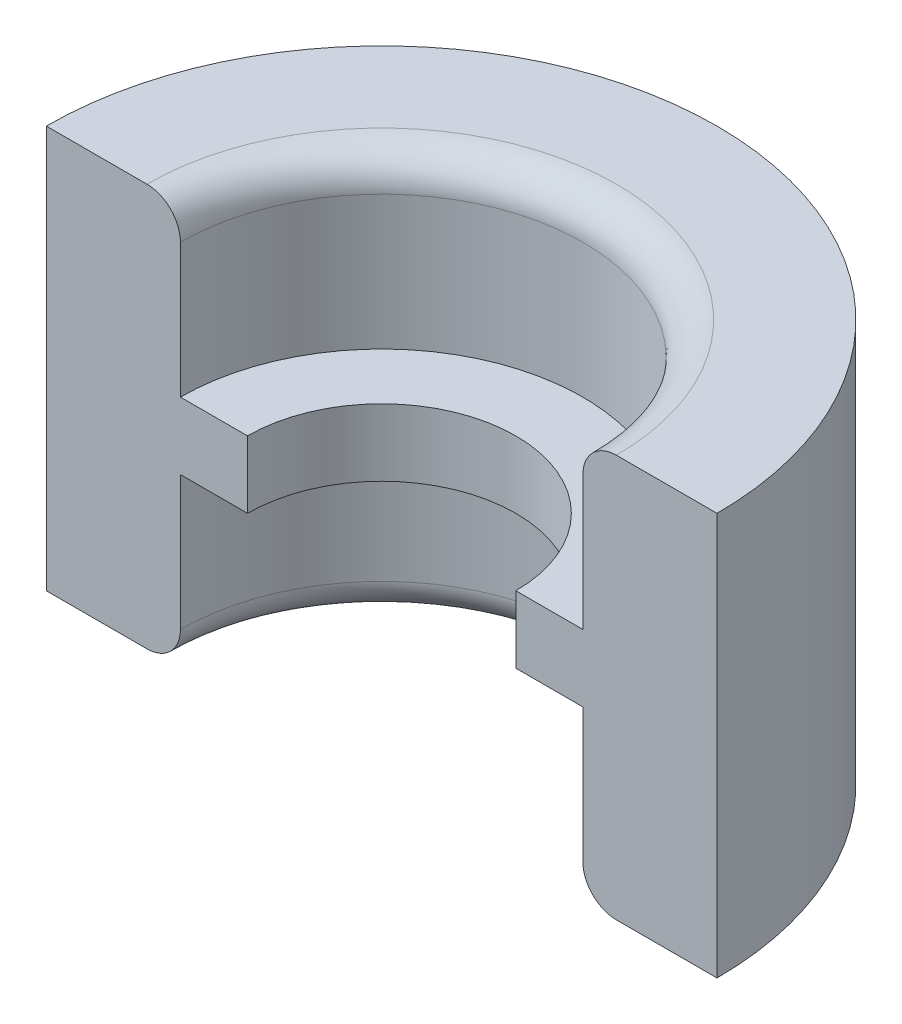
ISO-10303-21;
HEADER;
FILE_DESCRIPTION(('STEP AP214'),'2;1');
FILE_NAME('part.step','',(''),(''),'','','');
FILE_SCHEMA(('AUTOMOTIVE_DESIGN { 1 0 10303 214 1 1 1 1 }'));
ENDSEC;
DATA;
#1=APPLICATION_CONTEXT('core data for automotive mechanical design processes');
#2=APPLICATION_PROTOCOL_DEFINITION('international standard','automotive_design',2000,#1);
#3=PRODUCT_CONTEXT('',#1,'mechanical');
#4=PRODUCT('Part','Part','',(#3));
#5=PRODUCT_RELATED_PRODUCT_CATEGORY('part','',(#4));
#6=PRODUCT_DEFINITION_FORMATION('','',#4);
#7=PRODUCT_DEFINITION_CONTEXT('part definition',#1,'design');
#8=PRODUCT_DEFINITION('design','',#6,#7);
#9=PRODUCT_DEFINITION_SHAPE('','',#8);
#10=(LENGTH_UNIT() NAMED_UNIT(*) SI_UNIT(.MILLI.,.METRE.));
#11=(NAMED_UNIT(*) PLANE_ANGLE_UNIT() SI_UNIT($,.RADIAN.));
#12=(NAMED_UNIT(*) SI_UNIT($,.STERADIAN.) SOLID_ANGLE_UNIT());
#13=UNCERTAINTY_MEASURE_WITH_UNIT(LENGTH_MEASURE(1.E-05),#10,'distance_accuracy_value','');
#14=(GEOMETRIC_REPRESENTATION_CONTEXT(3) GLOBAL_UNCERTAINTY_ASSIGNED_CONTEXT((#13)) GLOBAL_UNIT_ASSIGNED_CONTEXT((#10,
#11,#12)) REPRESENTATION_CONTEXT('',''));
#15=CARTESIAN_POINT('',(0.,0.,0.));
#16=DIRECTION('',(0.,0.,1.));
#17=DIRECTION('',(1.,0.,0.));
#18=AXIS2_PLACEMENT_3D('',#15,#16,#17);
#19=CARTESIAN_POINT('',(0.,0.,0.));
#20=DIRECTION('',(0.,-1.,0.));
#21=DIRECTION('',(0.,0.,-1.));
#22=AXIS2_PLACEMENT_3D('',#19,#20,#21);
#23=CYLINDRICAL_SURFACE('',#22,2.);
#24=CARTESIAN_POINT('',(0.,-0.5,0.));
#25=DIRECTION('',(0.,-1.,0.));
#26=DIRECTION('',(0.,0.,-1.));
#27=AXIS2_PLACEMENT_3D('',#24,#25,#26);
#28=CIRCLE('',#27,2.);
#29=CARTESIAN_POINT('',(-2.,-0.5,0.));
#30=VERTEX_POINT('',#29);
#31=CARTESIAN_POINT('',(2.,-0.5,0.));
#32=VERTEX_POINT('',#31);
#33=EDGE_CURVE('E114',#30,#32,#28,.T.);
#34=ORIENTED_EDGE('',*,*,#33,.T.);
#35=DIRECTION('',(0.,-1.,0.));
#36=VECTOR('',#35,1.);
#37=CARTESIAN_POINT('',(2.,0.,0.));
#38=LINE('',#37,#36);
#39=CARTESIAN_POINT('',(2.,0.5,0.));
#40=VERTEX_POINT('',#39);
#41=EDGE_CURVE('E116',#40,#32,#38,.T.);
#42=ORIENTED_EDGE('',*,*,#41,.F.);
#43=CARTESIAN_POINT('',(0.,0.5,0.));
#44=DIRECTION('',(0.,-1.,0.));
#45=DIRECTION('',(0.,0.,-1.));
#46=AXIS2_PLACEMENT_3D('',#43,#44,#45);
#47=CIRCLE('',#46,2.);
#48=CARTESIAN_POINT('',(-2.,0.5,0.));
#49=VERTEX_POINT('',#48);
#50=EDGE_CURVE('E167',#49,#40,#47,.T.);
#51=ORIENTED_EDGE('',*,*,#50,.F.);
#52=DIRECTION('',(0.,-1.,0.));
#53=VECTOR('',#52,1.);
#54=CARTESIAN_POINT('',(-2.,0.,0.));
#55=LINE('',#54,#53);
#56=EDGE_CURVE('E119',#49,#30,#55,.T.);
#57=ORIENTED_EDGE('',*,*,#56,.T.);
#58=EDGE_LOOP('',(#34,#42,#51,#57));
#59=FACE_BOUND('',#58,.T.);
#60=ADVANCED_FACE('F38',(#59),#23,.F.);
#61=CARTESIAN_POINT('',(0.,-0.5,0.));
#62=DIRECTION('',(0.,-1.,0.));
#63=DIRECTION('',(0.,0.,-1.));
#64=AXIS2_PLACEMENT_3D('',#61,#62,#63);
#65=PLANE('',#64);
#66=CARTESIAN_POINT('',(0.,-0.5,0.));
#67=DIRECTION('',(0.,-1.,0.));
#68=DIRECTION('',(0.,0.,-1.));
#69=AXIS2_PLACEMENT_3D('',#66,#67,#68);
#70=CIRCLE('',#69,3.);
#71=CARTESIAN_POINT('',(-3.,-0.5,0.));
#72=VERTEX_POINT('',#71);
#73=CARTESIAN_POINT('',(3.,-0.5,0.));
#74=VERTEX_POINT('',#73);
#75=EDGE_CURVE('E125',#72,#74,#70,.T.);
#76=ORIENTED_EDGE('',*,*,#75,.T.);
#77=DIRECTION('',(1.,0.,0.));
#78=VECTOR('',#77,1.);
#79=CARTESIAN_POINT('',(0.,-0.500000000000001,0.));
#80=LINE('',#79,#78);
#81=EDGE_CURVE('E131',#32,#74,#80,.T.);
#82=ORIENTED_EDGE('',*,*,#81,.F.);
#83=ORIENTED_EDGE('',*,*,#33,.F.);
#84=DIRECTION('',(-1.,0.,0.));
#85=VECTOR('',#84,1.);
#86=CARTESIAN_POINT('',(0.,-0.500000000000001,0.));
#87=LINE('',#86,#85);
#88=EDGE_CURVE('E151',#30,#72,#87,.T.);
#89=ORIENTED_EDGE('',*,*,#88,.T.);
#90=EDGE_LOOP('',(#76,#82,#83,#89));
#91=FACE_BOUND('',#90,.T.);
#92=ADVANCED_FACE('F136',(#91),#65,.T.);
#93=CARTESIAN_POINT('',(0.,0.,0.));
#94=DIRECTION('',(0.,-1.,0.));
#95=DIRECTION('',(0.,0.,-1.));
#96=AXIS2_PLACEMENT_3D('',#93,#94,#95);
#97=CYLINDRICAL_SURFACE('',#96,3.);
#98=DIRECTION('',(0.,-1.,0.));
#99=VECTOR('',#98,1.);
#100=CARTESIAN_POINT('',(-3.,0.,0.));
#101=LINE('',#100,#99);
#102=CARTESIAN_POINT('',(-3.,-2.5,0.));
#103=VERTEX_POINT('',#102);
#104=EDGE_CURVE('E153',#72,#103,#101,.T.);
#105=ORIENTED_EDGE('',*,*,#104,.T.);
#106=CARTESIAN_POINT('',(0.,-2.5,0.));
#107=DIRECTION('',(0.,-1.,0.));
#108=DIRECTION('',(0.,0.,-1.));
#109=AXIS2_PLACEMENT_3D('',#106,#107,#108);
#110=CIRCLE('',#109,3.);
#111=CARTESIAN_POINT('',(3.,-2.5,0.));
#112=VERTEX_POINT('',#111);
#113=EDGE_CURVE('E124',#103,#112,#110,.T.);
#114=ORIENTED_EDGE('',*,*,#113,.T.);
#115=DIRECTION('',(0.,-1.,0.));
#116=VECTOR('',#115,1.);
#117=CARTESIAN_POINT('',(3.,0.,0.));
#118=LINE('',#117,#116);
#119=EDGE_CURVE('E137',#74,#112,#118,.T.);
#120=ORIENTED_EDGE('',*,*,#119,.F.);
#121=ORIENTED_EDGE('',*,*,#75,.F.);
#122=EDGE_LOOP('',(#105,#114,#120,#121));
#123=FACE_BOUND('',#122,.T.);
#124=ADVANCED_FACE('F212',(#123),#97,.F.);
#125=CARTESIAN_POINT('',(0.,-3.,0.));
#126=DIRECTION('',(0.,-1.,0.));
#127=DIRECTION('',(0.,0.,-1.));
#128=AXIS2_PLACEMENT_3D('',#125,#126,#127);
#129=PLANE('',#128);
#130=DIRECTION('',(1.,0.,0.));
#131=VECTOR('',#130,1.);
#132=CARTESIAN_POINT('',(0.,-3.,0.));
#133=LINE('',#132,#131);
#134=CARTESIAN_POINT('',(3.5,-3.,0.));
#135=VERTEX_POINT('',#134);
#136=CARTESIAN_POINT('',(5.,-3.,0.));
#137=VERTEX_POINT('',#136);
#138=EDGE_CURVE('E139',#135,#137,#133,.T.);
#139=ORIENTED_EDGE('',*,*,#138,.F.);
#140=CARTESIAN_POINT('',(0.,-3.,0.));
#141=DIRECTION('',(0.,-1.,0.));
#142=DIRECTION('',(0.,0.,-1.));
#143=AXIS2_PLACEMENT_3D('',#140,#141,#142);
#144=CIRCLE('',#143,3.5);
#145=CARTESIAN_POINT('',(-3.5,-3.,0.));
#146=VERTEX_POINT('',#145);
#147=EDGE_CURVE('E185',#135,#146,#144,.F.);
#148=ORIENTED_EDGE('',*,*,#147,.T.);
#149=DIRECTION('',(-1.,0.,0.));
#150=VECTOR('',#149,1.);
#151=CARTESIAN_POINT('',(0.,-3.,0.));
#152=LINE('',#151,#150);
#153=CARTESIAN_POINT('',(-5.,-3.,0.));
#154=VERTEX_POINT('',#153);
#155=EDGE_CURVE('E156',#146,#154,#152,.T.);
#156=ORIENTED_EDGE('',*,*,#155,.T.);
#157=CARTESIAN_POINT('',(0.,-3.,0.));
#158=DIRECTION('',(0.,-1.,0.));
#159=DIRECTION('',(0.,0.,-1.));
#160=AXIS2_PLACEMENT_3D('',#157,#158,#159);
#161=CIRCLE('',#160,5.);
#162=EDGE_CURVE('E175',#154,#137,#161,.T.);
#163=ORIENTED_EDGE('',*,*,#162,.T.);
#164=EDGE_LOOP('',(#139,#148,#156,#163));
#165=FACE_BOUND('',#164,.T.);
#166=ADVANCED_FACE('F213',(#165),#129,.T.);
#167=CARTESIAN_POINT('',(0.,0.,0.));
#168=DIRECTION('',(0.,-1.,0.));
#169=DIRECTION('',(0.,0.,-1.));
#170=AXIS2_PLACEMENT_3D('',#167,#168,#169);
#171=CYLINDRICAL_SURFACE('',#170,5.);
#172=CARTESIAN_POINT('',(0.,3.,0.));
#173=DIRECTION('',(0.,-1.,0.));
#174=DIRECTION('',(0.,0.,-1.));
#175=AXIS2_PLACEMENT_3D('',#172,#173,#174);
#176=CIRCLE('',#175,5.);
#177=CARTESIAN_POINT('',(-5.,3.,0.));
#178=VERTEX_POINT('',#177);
#179=CARTESIAN_POINT('',(5.,3.,0.));
#180=VERTEX_POINT('',#179);
#181=EDGE_CURVE('E172',#178,#180,#176,.T.);
#182=ORIENTED_EDGE('',*,*,#181,.T.);
#183=DIRECTION('',(0.,-1.,0.));
#184=VECTOR('',#183,1.);
#185=CARTESIAN_POINT('',(5.,0.,0.));
#186=LINE('',#185,#184);
#187=EDGE_CURVE('E144',#180,#137,#186,.T.);
#188=ORIENTED_EDGE('',*,*,#187,.T.);
#189=ORIENTED_EDGE('',*,*,#162,.F.);
#190=DIRECTION('',(0.,-1.,0.));
#191=VECTOR('',#190,1.);
#192=CARTESIAN_POINT('',(-5.,0.,0.));
#193=LINE('',#192,#191);
#194=EDGE_CURVE('E159',#178,#154,#193,.T.);
#195=ORIENTED_EDGE('',*,*,#194,.F.);
#196=EDGE_LOOP('',(#182,#188,#189,#195));
#197=FACE_BOUND('',#196,.T.);
#198=ADVANCED_FACE('F200',(#197),#171,.T.);
#199=CARTESIAN_POINT('',(0.,3.,0.));
#200=DIRECTION('',(0.,-1.,0.));
#201=DIRECTION('',(0.,0.,-1.));
#202=AXIS2_PLACEMENT_3D('',#199,#200,#201);
#203=PLANE('',#202);
#204=DIRECTION('',(-1.,0.,0.));
#205=VECTOR('',#204,1.);
#206=CARTESIAN_POINT('',(0.,3.,0.));
#207=LINE('',#206,#205);
#208=CARTESIAN_POINT('',(-3.5,3.,0.));
#209=VERTEX_POINT('',#208);
#210=EDGE_CURVE('E162',#209,#178,#207,.T.);
#211=ORIENTED_EDGE('',*,*,#210,.F.);
#212=CARTESIAN_POINT('',(0.,3.,0.));
#213=DIRECTION('',(0.,-1.,0.));
#214=DIRECTION('',(0.,0.,-1.));
#215=AXIS2_PLACEMENT_3D('',#212,#213,#214);
#216=CIRCLE('',#215,3.5);
#217=CARTESIAN_POINT('',(3.5,3.,0.));
#218=VERTEX_POINT('',#217);
#219=EDGE_CURVE('E46',#209,#218,#216,.T.);
#220=ORIENTED_EDGE('',*,*,#219,.T.);
#221=DIRECTION('',(1.,0.,0.));
#222=VECTOR('',#221,1.);
#223=CARTESIAN_POINT('',(0.,3.,0.));
#224=LINE('',#223,#222);
#225=EDGE_CURVE('E147',#218,#180,#224,.T.);
#226=ORIENTED_EDGE('',*,*,#225,.T.);
#227=ORIENTED_EDGE('',*,*,#181,.F.);
#228=EDGE_LOOP('',(#211,#220,#226,#227));
#229=FACE_BOUND('',#228,.T.);
#230=ADVANCED_FACE('F193',(#229),#203,.F.);
#231=CARTESIAN_POINT('',(3.,2.5,0.));
#232=VERTEX_POINT('',#231);
#233=CARTESIAN_POINT('',(3.,0.5,0.));
#234=VERTEX_POINT('',#233);
#235=EDGE_CURVE('E141',#232,#234,#118,.T.);
#236=ORIENTED_EDGE('',*,*,#235,.F.);
#237=CARTESIAN_POINT('',(0.,2.5,0.));
#238=DIRECTION('',(0.,-1.,0.));
#239=DIRECTION('',(0.,0.,-1.));
#240=AXIS2_PLACEMENT_3D('',#237,#238,#239);
#241=CIRCLE('',#240,3.);
#242=CARTESIAN_POINT('',(-3.,2.5,0.));
#243=VERTEX_POINT('',#242);
#244=EDGE_CURVE('E11',#232,#243,#241,.F.);
#245=ORIENTED_EDGE('',*,*,#244,.T.);
#246=CARTESIAN_POINT('',(-3.,0.5,0.));
#247=VERTEX_POINT('',#246);
#248=EDGE_CURVE('E157',#243,#247,#101,.T.);
#249=ORIENTED_EDGE('',*,*,#248,.T.);
#250=CARTESIAN_POINT('',(0.,0.5,0.));
#251=DIRECTION('',(0.,-1.,0.));
#252=DIRECTION('',(0.,0.,-1.));
#253=AXIS2_PLACEMENT_3D('',#250,#251,#252);
#254=CIRCLE('',#253,3.);
#255=EDGE_CURVE('E169',#247,#234,#254,.T.);
#256=ORIENTED_EDGE('',*,*,#255,.T.);
#257=EDGE_LOOP('',(#236,#245,#249,#256));
#258=FACE_BOUND('',#257,.T.);
#259=ADVANCED_FACE('F222',(#258),#97,.F.);
#260=CARTESIAN_POINT('',(0.,0.5,0.));
#261=DIRECTION('',(0.,-1.,0.));
#262=DIRECTION('',(0.,0.,-1.));
#263=AXIS2_PLACEMENT_3D('',#260,#261,#262);
#264=PLANE('',#263);
#265=DIRECTION('',(-1.,0.,0.));
#266=VECTOR('',#265,1.);
#267=CARTESIAN_POINT('',(0.,0.499999999999999,0.));
#268=LINE('',#267,#266);
#269=EDGE_CURVE('E164',#49,#247,#268,.T.);
#270=ORIENTED_EDGE('',*,*,#269,.F.);
#271=ORIENTED_EDGE('',*,*,#50,.T.);
#272=DIRECTION('',(1.,0.,0.));
#273=VECTOR('',#272,1.);
#274=CARTESIAN_POINT('',(0.,0.499999999999999,0.));
#275=LINE('',#274,#273);
#276=EDGE_CURVE('E134',#40,#234,#275,.T.);
#277=ORIENTED_EDGE('',*,*,#276,.T.);
#278=ORIENTED_EDGE('',*,*,#255,.F.);
#279=EDGE_LOOP('',(#270,#271,#277,#278));
#280=FACE_BOUND('',#279,.T.);
#281=ADVANCED_FACE('F232',(#280),#264,.F.);
#282=CARTESIAN_POINT('',(0.,0.,0.));
#283=DIRECTION('',(0.,0.,-1.));
#284=DIRECTION('',(-1.,0.,0.));
#285=AXIS2_PLACEMENT_3D('',#282,#283,#284);
#286=PLANE('',#285);
#287=ORIENTED_EDGE('',*,*,#155,.F.);
#288=CARTESIAN_POINT('',(-3.5,-2.5,0.));
#289=DIRECTION('',(0.,0.,-1.));
#290=DIRECTION('',(-1.,0.,0.));
#291=AXIS2_PLACEMENT_3D('',#288,#289,#290);
#292=CIRCLE('',#291,0.5);
#293=EDGE_CURVE('E188',#146,#103,#292,.F.);
#294=ORIENTED_EDGE('',*,*,#293,.T.);
#295=ORIENTED_EDGE('',*,*,#104,.F.);
#296=ORIENTED_EDGE('',*,*,#88,.F.);
#297=ORIENTED_EDGE('',*,*,#56,.F.);
#298=ORIENTED_EDGE('',*,*,#269,.T.);
#299=ORIENTED_EDGE('',*,*,#248,.F.);
#300=CARTESIAN_POINT('',(-3.5,2.5,0.));
#301=DIRECTION('',(0.,0.,-1.));
#302=DIRECTION('',(-1.,0.,0.));
#303=AXIS2_PLACEMENT_3D('',#300,#301,#302);
#304=CIRCLE('',#303,0.5);
#305=EDGE_CURVE('E53',#243,#209,#304,.F.);
#306=ORIENTED_EDGE('',*,*,#305,.T.);
#307=ORIENTED_EDGE('',*,*,#210,.T.);
#308=ORIENTED_EDGE('',*,*,#194,.T.);
#309=EDGE_LOOP('',(#287,#294,#295,#296,#297,#298,#299,#306,#307,#308));
#310=FACE_BOUND('',#309,.T.);
#311=ADVANCED_FACE('F203',(#310),#286,.F.);
#312=CARTESIAN_POINT('',(0.,0.,0.));
#313=DIRECTION('',(0.,0.,1.));
#314=DIRECTION('',(1.,0.,0.));
#315=AXIS2_PLACEMENT_3D('',#312,#313,#314);
#316=PLANE('',#315);
#317=ORIENTED_EDGE('',*,*,#119,.T.);
#318=CARTESIAN_POINT('',(3.5,-2.5,0.));
#319=DIRECTION('',(0.,0.,1.));
#320=DIRECTION('',(1.,0.,0.));
#321=AXIS2_PLACEMENT_3D('',#318,#319,#320);
#322=CIRCLE('',#321,0.5);
#323=EDGE_CURVE('E183',#112,#135,#322,.T.);
#324=ORIENTED_EDGE('',*,*,#323,.T.);
#325=ORIENTED_EDGE('',*,*,#138,.T.);
#326=ORIENTED_EDGE('',*,*,#187,.F.);
#327=ORIENTED_EDGE('',*,*,#225,.F.);
#328=CARTESIAN_POINT('',(3.5,2.5,0.));
#329=DIRECTION('',(0.,0.,1.));
#330=DIRECTION('',(1.,0.,0.));
#331=AXIS2_PLACEMENT_3D('',#328,#329,#330);
#332=CIRCLE('',#331,0.5);
#333=EDGE_CURVE('E181',#218,#232,#332,.T.);
#334=ORIENTED_EDGE('',*,*,#333,.T.);
#335=ORIENTED_EDGE('',*,*,#235,.T.);
#336=ORIENTED_EDGE('',*,*,#276,.F.);
#337=ORIENTED_EDGE('',*,*,#41,.T.);
#338=ORIENTED_EDGE('',*,*,#81,.T.);
#339=EDGE_LOOP('',(#317,#324,#325,#326,#327,#334,#335,#336,#337,#338));
#340=FACE_BOUND('',#339,.T.);
#341=ADVANCED_FACE('F130',(#340),#316,.T.);
#342=CARTESIAN_POINT('',(0.,-2.5,0.));
#343=DIRECTION('',(0.,-1.,0.));
#344=DIRECTION('',(0.,0.,-1.));
#345=AXIS2_PLACEMENT_3D('',#342,#343,#344);
#346=TOROIDAL_SURFACE('',#345,3.5,0.5);
#347=ORIENTED_EDGE('',*,*,#293,.F.);
#348=ORIENTED_EDGE('',*,*,#147,.F.);
#349=ORIENTED_EDGE('',*,*,#323,.F.);
#350=ORIENTED_EDGE('',*,*,#113,.F.);
#351=EDGE_LOOP('',(#347,#348,#349,#350));
#352=FACE_BOUND('',#351,.T.);
#353=ADVANCED_FACE('F210',(#352),#346,.T.);
#354=CARTESIAN_POINT('',(0.,2.5,0.));
#355=DIRECTION('',(0.,-1.,0.));
#356=DIRECTION('',(0.,0.,-1.));
#357=AXIS2_PLACEMENT_3D('',#354,#355,#356);
#358=TOROIDAL_SURFACE('',#357,3.5,0.5);
#359=ORIENTED_EDGE('',*,*,#305,.F.);
#360=ORIENTED_EDGE('',*,*,#244,.F.);
#361=ORIENTED_EDGE('',*,*,#333,.F.);
#362=ORIENTED_EDGE('',*,*,#219,.F.);
#363=EDGE_LOOP('',(#359,#360,#361,#362));
#364=FACE_BOUND('',#363,.T.);
#365=ADVANCED_FACE('F40',(#364),#358,.T.);
#366=CLOSED_SHELL('',(#60,#92,#124,#166,#198,#230,#259,#281,#311,#341,#353,#365));
#367=MANIFOLD_SOLID_BREP('B2',#366);
#368=ADVANCED_BREP_SHAPE_REPRESENTATION('',(#18,#367),#14);
#369=SHAPE_DEFINITION_REPRESENTATION(#9,#368);
ENDSEC;
END-ISO-10303-21;
